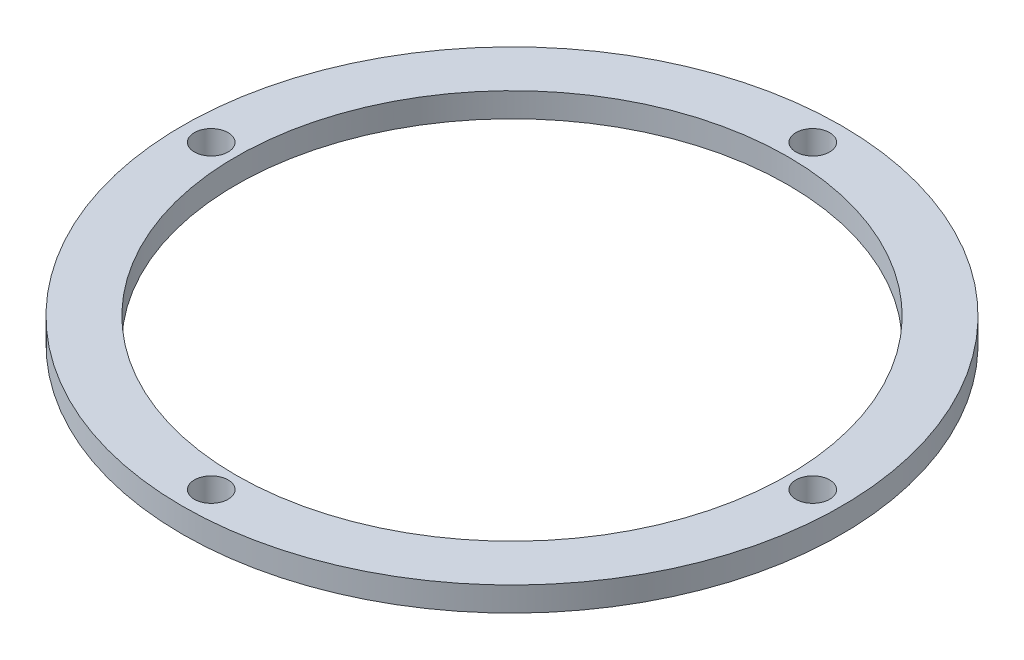
ISO-10303-21;
HEADER;
FILE_DESCRIPTION(('STEP AP214'),'2;1');
FILE_NAME('part.step','',(''),(''),'','','');
FILE_SCHEMA(('AUTOMOTIVE_DESIGN { 1 0 10303 214 1 1 1 1 }'));
ENDSEC;
DATA;
#1=APPLICATION_CONTEXT('core data for automotive mechanical design processes');
#2=APPLICATION_PROTOCOL_DEFINITION('international standard','automotive_design',2000,#1);
#3=PRODUCT_CONTEXT('',#1,'mechanical');
#4=PRODUCT('Part','Part','',(#3));
#5=PRODUCT_RELATED_PRODUCT_CATEGORY('part','',(#4));
#6=PRODUCT_DEFINITION_FORMATION('','',#4);
#7=PRODUCT_DEFINITION_CONTEXT('part definition',#1,'design');
#8=PRODUCT_DEFINITION('design','',#6,#7);
#9=PRODUCT_DEFINITION_SHAPE('','',#8);
#10=(LENGTH_UNIT() NAMED_UNIT(*) SI_UNIT(.MILLI.,.METRE.));
#11=(NAMED_UNIT(*) PLANE_ANGLE_UNIT() SI_UNIT($,.RADIAN.));
#12=(NAMED_UNIT(*) SI_UNIT($,.STERADIAN.) SOLID_ANGLE_UNIT());
#13=UNCERTAINTY_MEASURE_WITH_UNIT(LENGTH_MEASURE(1.E-05),#10,'distance_accuracy_value','');
#14=(GEOMETRIC_REPRESENTATION_CONTEXT(3) GLOBAL_UNCERTAINTY_ASSIGNED_CONTEXT((#13)) GLOBAL_UNIT_ASSIGNED_CONTEXT((#10,
#11,#12)) REPRESENTATION_CONTEXT('',''));
#15=CARTESIAN_POINT('',(0.,0.,0.));
#16=DIRECTION('',(0.,0.,1.));
#17=DIRECTION('',(1.,0.,0.));
#18=AXIS2_PLACEMENT_3D('',#15,#16,#17);
#19=CARTESIAN_POINT('',(0.,6.35,0.));
#20=DIRECTION('',(0.,1.,0.));
#21=DIRECTION('',(0.,0.,1.));
#22=AXIS2_PLACEMENT_3D('',#19,#20,#21);
#23=PLANE('',#22);
#24=CARTESIAN_POINT('',(-5.4808505931265E-13,6.35,78.4889));
#25=DIRECTION('',(0.,1.,0.));
#26=DIRECTION('',(0.,0.,1.));
#27=AXIS2_PLACEMENT_3D('',#24,#25,#26);
#28=CIRCLE('',#27,4.40000000000001);
#29=CARTESIAN_POINT('',(-5.4808505931265E-13,6.35,82.8889));
#30=VERTEX_POINT('',#29);
#31=EDGE_CURVE('E68',#30,#30,#28,.T.);
#32=ORIENTED_EDGE('',*,*,#31,.F.);
#33=EDGE_LOOP('',(#32));
#34=FACE_BOUND('',#33,.T.);
#35=CARTESIAN_POINT('',(0.,6.35,-78.4889));
#36=DIRECTION('',(0.,1.,0.));
#37=DIRECTION('',(0.,0.,1.));
#38=AXIS2_PLACEMENT_3D('',#35,#36,#37);
#39=CIRCLE('',#38,4.40000000000001);
#40=CARTESIAN_POINT('',(0.,6.35,-74.0889));
#41=VERTEX_POINT('',#40);
#42=EDGE_CURVE('E56',#41,#41,#39,.T.);
#43=ORIENTED_EDGE('',*,*,#42,.F.);
#44=EDGE_LOOP('',(#43));
#45=FACE_BOUND('',#44,.T.);
#46=CARTESIAN_POINT('',(0.,6.35,0.));
#47=DIRECTION('',(0.,1.,0.));
#48=DIRECTION('',(0.,0.,1.));
#49=AXIS2_PLACEMENT_3D('',#46,#47,#48);
#50=CIRCLE('',#49,86.);
#51=CARTESIAN_POINT('',(0.,6.35,86.));
#52=VERTEX_POINT('',#51);
#53=EDGE_CURVE('E10',#52,#52,#50,.T.);
#54=ORIENTED_EDGE('',*,*,#53,.T.);
#55=EDGE_LOOP('',(#54));
#56=FACE_BOUND('',#55,.T.);
#57=CARTESIAN_POINT('',(0.,6.35,0.));
#58=DIRECTION('',(0.,1.,0.));
#59=DIRECTION('',(0.,0.,1.));
#60=AXIS2_PLACEMENT_3D('',#57,#58,#59);
#61=CIRCLE('',#60,72.);
#62=CARTESIAN_POINT('',(0.,6.35,72.));
#63=VERTEX_POINT('',#62);
#64=EDGE_CURVE('E51',#63,#63,#61,.T.);
#65=ORIENTED_EDGE('',*,*,#64,.F.);
#66=EDGE_LOOP('',(#65));
#67=FACE_BOUND('',#66,.T.);
#68=CARTESIAN_POINT('',(78.4889,6.35,2.74042529656325E-13));
#69=DIRECTION('',(0.,1.,0.));
#70=DIRECTION('',(0.,0.,1.));
#71=AXIS2_PLACEMENT_3D('',#68,#69,#70);
#72=CIRCLE('',#71,4.40000000000001);
#73=CARTESIAN_POINT('',(78.4889,6.35,4.40000000000029));
#74=VERTEX_POINT('',#73);
#75=EDGE_CURVE('E62',#74,#74,#72,.T.);
#76=ORIENTED_EDGE('',*,*,#75,.F.);
#77=EDGE_LOOP('',(#76));
#78=FACE_BOUND('',#77,.T.);
#79=CARTESIAN_POINT('',(-78.4889,6.35,-8.22127588968974E-13));
#80=DIRECTION('',(0.,1.,0.));
#81=DIRECTION('',(0.,0.,1.));
#82=AXIS2_PLACEMENT_3D('',#79,#80,#81);
#83=CIRCLE('',#82,4.40000000000001);
#84=CARTESIAN_POINT('',(-78.4889,6.35,4.39999999999919));
#85=VERTEX_POINT('',#84);
#86=EDGE_CURVE('E74',#85,#85,#83,.T.);
#87=ORIENTED_EDGE('',*,*,#86,.F.);
#88=EDGE_LOOP('',(#87));
#89=FACE_BOUND('',#88,.T.);
#90=ADVANCED_FACE('F40',(#34,#45,#56,#67,#78,#89),#23,.T.);
#91=CARTESIAN_POINT('',(0.,0.,0.));
#92=DIRECTION('',(0.,1.,0.));
#93=DIRECTION('',(0.,0.,1.));
#94=AXIS2_PLACEMENT_3D('',#91,#92,#93);
#95=PLANE('',#94);
#96=CARTESIAN_POINT('',(0.,0.,0.));
#97=DIRECTION('',(0.,1.,0.));
#98=DIRECTION('',(0.,0.,1.));
#99=AXIS2_PLACEMENT_3D('',#96,#97,#98);
#100=CIRCLE('',#99,86.);
#101=CARTESIAN_POINT('',(0.,0.,86.));
#102=VERTEX_POINT('',#101);
#103=EDGE_CURVE('E44',#102,#102,#100,.T.);
#104=ORIENTED_EDGE('',*,*,#103,.F.);
#105=EDGE_LOOP('',(#104));
#106=FACE_BOUND('',#105,.T.);
#107=CARTESIAN_POINT('',(0.,0.,0.));
#108=DIRECTION('',(0.,1.,0.));
#109=DIRECTION('',(0.,0.,1.));
#110=AXIS2_PLACEMENT_3D('',#107,#108,#109);
#111=CIRCLE('',#110,72.);
#112=CARTESIAN_POINT('',(0.,0.,72.));
#113=VERTEX_POINT('',#112);
#114=EDGE_CURVE('E53',#113,#113,#111,.T.);
#115=ORIENTED_EDGE('',*,*,#114,.T.);
#116=EDGE_LOOP('',(#115));
#117=FACE_BOUND('',#116,.T.);
#118=CARTESIAN_POINT('',(0.,0.,-78.4889));
#119=DIRECTION('',(0.,1.,0.));
#120=DIRECTION('',(0.,0.,1.));
#121=AXIS2_PLACEMENT_3D('',#118,#119,#120);
#122=CIRCLE('',#121,4.40000000000001);
#123=CARTESIAN_POINT('',(0.,0.,-74.0889));
#124=VERTEX_POINT('',#123);
#125=EDGE_CURVE('E59',#124,#124,#122,.T.);
#126=ORIENTED_EDGE('',*,*,#125,.T.);
#127=EDGE_LOOP('',(#126));
#128=FACE_BOUND('',#127,.T.);
#129=CARTESIAN_POINT('',(78.4889,0.,2.74042529656325E-13));
#130=DIRECTION('',(0.,1.,0.));
#131=DIRECTION('',(0.,0.,1.));
#132=AXIS2_PLACEMENT_3D('',#129,#130,#131);
#133=CIRCLE('',#132,4.40000000000001);
#134=CARTESIAN_POINT('',(78.4889,0.,4.40000000000029));
#135=VERTEX_POINT('',#134);
#136=EDGE_CURVE('E65',#135,#135,#133,.T.);
#137=ORIENTED_EDGE('',*,*,#136,.T.);
#138=EDGE_LOOP('',(#137));
#139=FACE_BOUND('',#138,.T.);
#140=CARTESIAN_POINT('',(-5.4808505931265E-13,0.,78.4889));
#141=DIRECTION('',(0.,1.,0.));
#142=DIRECTION('',(0.,0.,1.));
#143=AXIS2_PLACEMENT_3D('',#140,#141,#142);
#144=CIRCLE('',#143,4.40000000000001);
#145=CARTESIAN_POINT('',(-5.4808505931265E-13,0.,82.8889));
#146=VERTEX_POINT('',#145);
#147=EDGE_CURVE('E71',#146,#146,#144,.T.);
#148=ORIENTED_EDGE('',*,*,#147,.T.);
#149=EDGE_LOOP('',(#148));
#150=FACE_BOUND('',#149,.T.);
#151=CARTESIAN_POINT('',(-78.4889,0.,-8.22127588968974E-13));
#152=DIRECTION('',(0.,1.,0.));
#153=DIRECTION('',(0.,0.,1.));
#154=AXIS2_PLACEMENT_3D('',#151,#152,#153);
#155=CIRCLE('',#154,4.40000000000001);
#156=CARTESIAN_POINT('',(-78.4889,0.,4.39999999999919));
#157=VERTEX_POINT('',#156);
#158=EDGE_CURVE('E77',#157,#157,#155,.T.);
#159=ORIENTED_EDGE('',*,*,#158,.T.);
#160=EDGE_LOOP('',(#159));
#161=FACE_BOUND('',#160,.T.);
#162=ADVANCED_FACE('F87',(#106,#117,#128,#139,#150,#161),#95,.F.);
#163=CARTESIAN_POINT('',(0.,6.35,0.));
#164=DIRECTION('',(0.,-1.,0.));
#165=DIRECTION('',(0.,0.,-1.));
#166=AXIS2_PLACEMENT_3D('',#163,#164,#165);
#167=CYLINDRICAL_SURFACE('',#166,86.);
#168=ORIENTED_EDGE('',*,*,#53,.F.);
#169=EDGE_LOOP('',(#168));
#170=FACE_BOUND('',#169,.T.);
#171=ORIENTED_EDGE('',*,*,#103,.T.);
#172=EDGE_LOOP('',(#171));
#173=FACE_BOUND('',#172,.T.);
#174=ADVANCED_FACE('F42',(#170,#173),#167,.T.);
#175=CARTESIAN_POINT('',(0.,6.35,0.));
#176=DIRECTION('',(0.,-1.,0.));
#177=DIRECTION('',(0.,0.,-1.));
#178=AXIS2_PLACEMENT_3D('',#175,#176,#177);
#179=CYLINDRICAL_SURFACE('',#178,72.);
#180=ORIENTED_EDGE('',*,*,#64,.T.);
#181=EDGE_LOOP('',(#180));
#182=FACE_BOUND('',#181,.T.);
#183=ORIENTED_EDGE('',*,*,#114,.F.);
#184=EDGE_LOOP('',(#183));
#185=FACE_BOUND('',#184,.T.);
#186=ADVANCED_FACE('F97',(#182,#185),#179,.F.);
#187=CARTESIAN_POINT('',(0.,6.35,-78.4889));
#188=DIRECTION('',(0.,-1.,0.));
#189=DIRECTION('',(0.,0.,-1.));
#190=AXIS2_PLACEMENT_3D('',#187,#188,#189);
#191=CYLINDRICAL_SURFACE('',#190,4.40000000000001);
#192=ORIENTED_EDGE('',*,*,#42,.T.);
#193=EDGE_LOOP('',(#192));
#194=FACE_BOUND('',#193,.T.);
#195=ORIENTED_EDGE('',*,*,#125,.F.);
#196=EDGE_LOOP('',(#195));
#197=FACE_BOUND('',#196,.T.);
#198=ADVANCED_FACE('F100',(#194,#197),#191,.F.);
#199=CARTESIAN_POINT('',(78.4889,6.35,2.74042529656325E-13));
#200=DIRECTION('',(0.,-1.,0.));
#201=DIRECTION('',(0.,0.,-1.));
#202=AXIS2_PLACEMENT_3D('',#199,#200,#201);
#203=CYLINDRICAL_SURFACE('',#202,4.40000000000001);
#204=ORIENTED_EDGE('',*,*,#75,.T.);
#205=EDGE_LOOP('',(#204));
#206=FACE_BOUND('',#205,.T.);
#207=ORIENTED_EDGE('',*,*,#136,.F.);
#208=EDGE_LOOP('',(#207));
#209=FACE_BOUND('',#208,.T.);
#210=ADVANCED_FACE('F104',(#206,#209),#203,.F.);
#211=CARTESIAN_POINT('',(-5.4808505931265E-13,6.35,78.4889));
#212=DIRECTION('',(0.,-1.,0.));
#213=DIRECTION('',(0.,0.,-1.));
#214=AXIS2_PLACEMENT_3D('',#211,#212,#213);
#215=CYLINDRICAL_SURFACE('',#214,4.40000000000001);
#216=ORIENTED_EDGE('',*,*,#31,.T.);
#217=EDGE_LOOP('',(#216));
#218=FACE_BOUND('',#217,.T.);
#219=ORIENTED_EDGE('',*,*,#147,.F.);
#220=EDGE_LOOP('',(#219));
#221=FACE_BOUND('',#220,.T.);
#222=ADVANCED_FACE('F108',(#218,#221),#215,.F.);
#223=CARTESIAN_POINT('',(-78.4889,6.35,-8.22127588968974E-13));
#224=DIRECTION('',(0.,-1.,0.));
#225=DIRECTION('',(0.,0.,-1.));
#226=AXIS2_PLACEMENT_3D('',#223,#224,#225);
#227=CYLINDRICAL_SURFACE('',#226,4.40000000000001);
#228=ORIENTED_EDGE('',*,*,#86,.T.);
#229=EDGE_LOOP('',(#228));
#230=FACE_BOUND('',#229,.T.);
#231=ORIENTED_EDGE('',*,*,#158,.F.);
#232=EDGE_LOOP('',(#231));
#233=FACE_BOUND('',#232,.T.);
#234=ADVANCED_FACE('F83',(#230,#233),#227,.F.);
#235=CLOSED_SHELL('',(#90,#162,#174,#186,#198,#210,#222,#234));
#236=MANIFOLD_SOLID_BREP('B2',#235);
#237=ADVANCED_BREP_SHAPE_REPRESENTATION('',(#18,#236),#14);
#238=SHAPE_DEFINITION_REPRESENTATION(#9,#237);
ENDSEC;
END-ISO-10303-21;
